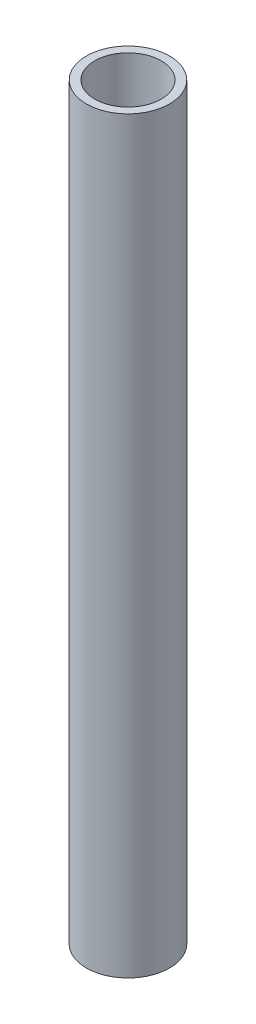
ISO-10303-21;
HEADER;
FILE_DESCRIPTION(('STEP AP214'),'2;1');
FILE_NAME('part.step','',(''),(''),'','','');
FILE_SCHEMA(('AUTOMOTIVE_DESIGN { 1 0 10303 214 1 1 1 1 }'));
ENDSEC;
DATA;
#1=APPLICATION_CONTEXT('core data for automotive mechanical design processes');
#2=APPLICATION_PROTOCOL_DEFINITION('international standard','automotive_design',2000,#1);
#3=PRODUCT_CONTEXT('',#1,'mechanical');
#4=PRODUCT('Part','Part','',(#3));
#5=PRODUCT_RELATED_PRODUCT_CATEGORY('part','',(#4));
#6=PRODUCT_DEFINITION_FORMATION('','',#4);
#7=PRODUCT_DEFINITION_CONTEXT('part definition',#1,'design');
#8=PRODUCT_DEFINITION('design','',#6,#7);
#9=PRODUCT_DEFINITION_SHAPE('','',#8);
#10=(LENGTH_UNIT() NAMED_UNIT(*) SI_UNIT(.MILLI.,.METRE.));
#11=(NAMED_UNIT(*) PLANE_ANGLE_UNIT() SI_UNIT($,.RADIAN.));
#12=(NAMED_UNIT(*) SI_UNIT($,.STERADIAN.) SOLID_ANGLE_UNIT());
#13=UNCERTAINTY_MEASURE_WITH_UNIT(LENGTH_MEASURE(1.E-05),#10,'distance_accuracy_value','');
#14=(GEOMETRIC_REPRESENTATION_CONTEXT(3) GLOBAL_UNCERTAINTY_ASSIGNED_CONTEXT((#13)) GLOBAL_UNIT_ASSIGNED_CONTEXT((#10,
#11,#12)) REPRESENTATION_CONTEXT('',''));
#15=CARTESIAN_POINT('',(0.,0.,0.));
#16=DIRECTION('',(0.,0.,1.));
#17=DIRECTION('',(1.,0.,0.));
#18=AXIS2_PLACEMENT_3D('',#15,#16,#17);
#19=CARTESIAN_POINT('',(0.,450.,0.));
#20=DIRECTION('',(0.,1.,0.));
#21=DIRECTION('',(0.,0.,1.));
#22=AXIS2_PLACEMENT_3D('',#19,#20,#21);
#23=PLANE('',#22);
#24=CARTESIAN_POINT('',(0.,450.,0.));
#25=DIRECTION('',(0.,1.,0.));
#26=DIRECTION('',(0.,0.,1.));
#27=AXIS2_PLACEMENT_3D('',#24,#25,#26);
#28=CIRCLE('',#27,25.);
#29=CARTESIAN_POINT('',(0.,450.,25.));
#30=VERTEX_POINT('',#29);
#31=EDGE_CURVE('E10',#30,#30,#28,.T.);
#32=ORIENTED_EDGE('',*,*,#31,.T.);
#33=EDGE_LOOP('',(#32));
#34=FACE_BOUND('',#33,.T.);
#35=CARTESIAN_POINT('',(0.,450.,0.));
#36=DIRECTION('',(0.,1.,0.));
#37=DIRECTION('',(0.,0.,1.));
#38=AXIS2_PLACEMENT_3D('',#35,#36,#37);
#39=CIRCLE('',#38,20.);
#40=CARTESIAN_POINT('',(0.,450.,20.));
#41=VERTEX_POINT('',#40);
#42=EDGE_CURVE('E54',#41,#41,#39,.T.);
#43=ORIENTED_EDGE('',*,*,#42,.F.);
#44=EDGE_LOOP('',(#43));
#45=FACE_BOUND('',#44,.T.);
#46=ADVANCED_FACE('F41',(#34,#45),#23,.T.);
#47=CARTESIAN_POINT('',(0.,0.,0.));
#48=DIRECTION('',(0.,1.,0.));
#49=DIRECTION('',(0.,0.,1.));
#50=AXIS2_PLACEMENT_3D('',#47,#48,#49);
#51=PLANE('',#50);
#52=CARTESIAN_POINT('',(0.,0.,0.));
#53=DIRECTION('',(0.,1.,0.));
#54=DIRECTION('',(0.,0.,1.));
#55=AXIS2_PLACEMENT_3D('',#52,#53,#54);
#56=CIRCLE('',#55,25.);
#57=CARTESIAN_POINT('',(0.,0.,25.));
#58=VERTEX_POINT('',#57);
#59=EDGE_CURVE('E45',#58,#58,#56,.T.);
#60=ORIENTED_EDGE('',*,*,#59,.F.);
#61=EDGE_LOOP('',(#60));
#62=FACE_BOUND('',#61,.T.);
#63=CARTESIAN_POINT('',(0.,0.,0.));
#64=DIRECTION('',(0.,1.,0.));
#65=DIRECTION('',(0.,0.,1.));
#66=AXIS2_PLACEMENT_3D('',#63,#64,#65);
#67=CIRCLE('',#66,20.);
#68=CARTESIAN_POINT('',(0.,0.,20.));
#69=VERTEX_POINT('',#68);
#70=EDGE_CURVE('E56',#69,#69,#67,.T.);
#71=ORIENTED_EDGE('',*,*,#70,.T.);
#72=EDGE_LOOP('',(#71));
#73=FACE_BOUND('',#72,.T.);
#74=ADVANCED_FACE('F68',(#62,#73),#51,.F.);
#75=CARTESIAN_POINT('',(0.,450.,0.));
#76=DIRECTION('',(0.,-1.,0.));
#77=DIRECTION('',(0.,0.,-1.));
#78=AXIS2_PLACEMENT_3D('',#75,#76,#77);
#79=CYLINDRICAL_SURFACE('',#78,25.);
#80=ORIENTED_EDGE('',*,*,#31,.F.);
#81=EDGE_LOOP('',(#80));
#82=FACE_BOUND('',#81,.T.);
#83=ORIENTED_EDGE('',*,*,#59,.T.);
#84=EDGE_LOOP('',(#83));
#85=FACE_BOUND('',#84,.T.);
#86=ADVANCED_FACE('F43',(#82,#85),#79,.T.);
#87=CARTESIAN_POINT('',(0.,450.,0.));
#88=DIRECTION('',(0.,-1.,0.));
#89=DIRECTION('',(0.,0.,-1.));
#90=AXIS2_PLACEMENT_3D('',#87,#88,#89);
#91=CYLINDRICAL_SURFACE('',#90,20.);
#92=ORIENTED_EDGE('',*,*,#42,.T.);
#93=EDGE_LOOP('',(#92));
#94=FACE_BOUND('',#93,.T.);
#95=ORIENTED_EDGE('',*,*,#70,.F.);
#96=EDGE_LOOP('',(#95));
#97=FACE_BOUND('',#96,.T.);
#98=ADVANCED_FACE('F64',(#94,#97),#91,.F.);
#99=CLOSED_SHELL('',(#46,#74,#86,#98));
#100=MANIFOLD_SOLID_BREP('B2',#99);
#101=ADVANCED_BREP_SHAPE_REPRESENTATION('',(#18,#100),#14);
#102=SHAPE_DEFINITION_REPRESENTATION(#9,#101);
ENDSEC;
END-ISO-10303-21;
